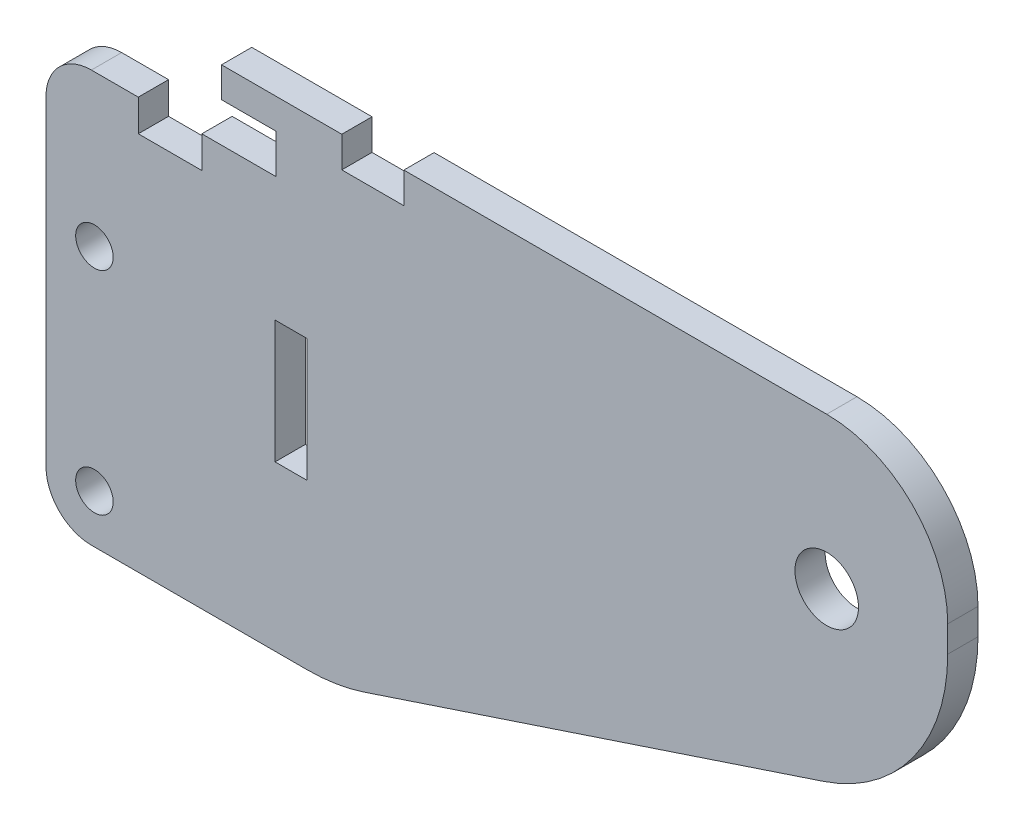
ISO-10303-21;
HEADER;
FILE_DESCRIPTION(('STEP AP214'),'2;1');
FILE_NAME('part.step','',(''),(''),'','','');
FILE_SCHEMA(('AUTOMOTIVE_DESIGN { 1 0 10303 214 1 1 1 1 }'));
ENDSEC;
DATA;
#1=APPLICATION_CONTEXT('core data for automotive mechanical design processes');
#2=APPLICATION_PROTOCOL_DEFINITION('international standard','automotive_design',2000,#1);
#3=PRODUCT_CONTEXT('',#1,'mechanical');
#4=PRODUCT('Part','Part','',(#3));
#5=PRODUCT_RELATED_PRODUCT_CATEGORY('part','',(#4));
#6=PRODUCT_DEFINITION_FORMATION('','',#4);
#7=PRODUCT_DEFINITION_CONTEXT('part definition',#1,'design');
#8=PRODUCT_DEFINITION('design','',#6,#7);
#9=PRODUCT_DEFINITION_SHAPE('','',#8);
#10=(LENGTH_UNIT() NAMED_UNIT(*) SI_UNIT(.MILLI.,.METRE.));
#11=(NAMED_UNIT(*) PLANE_ANGLE_UNIT() SI_UNIT($,.RADIAN.));
#12=(NAMED_UNIT(*) SI_UNIT($,.STERADIAN.) SOLID_ANGLE_UNIT());
#13=UNCERTAINTY_MEASURE_WITH_UNIT(LENGTH_MEASURE(1.E-05),#10,'distance_accuracy_value','');
#14=(GEOMETRIC_REPRESENTATION_CONTEXT(3) GLOBAL_UNCERTAINTY_ASSIGNED_CONTEXT((#13)) GLOBAL_UNIT_ASSIGNED_CONTEXT((#10,
#11,#12)) REPRESENTATION_CONTEXT('',''));
#15=CARTESIAN_POINT('',(0.,0.,0.));
#16=DIRECTION('',(0.,0.,1.));
#17=DIRECTION('',(1.,0.,0.));
#18=AXIS2_PLACEMENT_3D('',#15,#16,#17);
#19=CARTESIAN_POINT('',(0.,5.49999999999999,61.));
#20=DIRECTION('',(0.,1.,0.));
#21=DIRECTION('',(-1.,0.,0.));
#22=AXIS2_PLACEMENT_3D('',#19,#20,#21);
#23=PLANE('',#22);
#24=DIRECTION('',(0.,0.,1.));
#25=VECTOR('',#24,1.);
#26=CARTESIAN_POINT('',(21.125,5.49999999999999,0.));
#27=LINE('',#26,#25);
#28=CARTESIAN_POINT('',(21.125,5.49999999999999,56.));
#29=VERTEX_POINT('',#28);
#30=CARTESIAN_POINT('',(21.125,5.49999999999999,61.));
#31=VERTEX_POINT('',#30);
#32=EDGE_CURVE('E214',#29,#31,#27,.T.);
#33=ORIENTED_EDGE('',*,*,#32,.T.);
#34=DIRECTION('',(1.,0.,0.));
#35=VECTOR('',#34,1.);
#36=CARTESIAN_POINT('',(0.,5.49999999999999,61.));
#37=LINE('',#36,#35);
#38=CARTESIAN_POINT('',(91.,5.5,61.));
#39=VERTEX_POINT('',#38);
#40=EDGE_CURVE('E226',#31,#39,#37,.T.);
#41=ORIENTED_EDGE('',*,*,#40,.T.);
#42=DIRECTION('',(0.,0.,-1.));
#43=VECTOR('',#42,1.);
#44=CARTESIAN_POINT('',(91.,5.5,56.));
#45=LINE('',#44,#43);
#46=CARTESIAN_POINT('',(91.,5.5,56.));
#47=VERTEX_POINT('',#46);
#48=EDGE_CURVE('E307',#39,#47,#45,.T.);
#49=ORIENTED_EDGE('',*,*,#48,.T.);
#50=DIRECTION('',(1.,0.,0.));
#51=VECTOR('',#50,1.);
#52=CARTESIAN_POINT('',(0.,5.49999999999999,56.));
#53=LINE('',#52,#51);
#54=EDGE_CURVE('E228',#29,#47,#53,.T.);
#55=ORIENTED_EDGE('',*,*,#54,.F.);
#56=EDGE_LOOP('',(#33,#41,#49,#55));
#57=FACE_BOUND('',#56,.T.);
#58=ADVANCED_FACE('F38',(#57),#23,.T.);
#59=CARTESIAN_POINT('',(0.,-6.00000000000001,61.));
#60=DIRECTION('',(0.,-1.,0.));
#61=DIRECTION('',(1.,0.,0.));
#62=AXIS2_PLACEMENT_3D('',#59,#60,#61);
#63=PLANE('',#62);
#64=DIRECTION('',(-1.,0.,0.));
#65=VECTOR('',#64,1.);
#66=CARTESIAN_POINT('',(0.,-6.00000000000001,56.));
#67=LINE('',#66,#65);
#68=CARTESIAN_POINT('',(0.,-6.00000000000001,56.));
#69=VERTEX_POINT('',#68);
#70=CARTESIAN_POINT('',(-12.25,-6.00000000000001,56.));
#71=VERTEX_POINT('',#70);
#72=EDGE_CURVE('E288',#69,#71,#67,.T.);
#73=ORIENTED_EDGE('',*,*,#72,.T.);
#74=DIRECTION('',(0.,0.,1.));
#75=VECTOR('',#74,1.);
#76=CARTESIAN_POINT('',(-12.25,-6.00000000000001,61.));
#77=LINE('',#76,#75);
#78=CARTESIAN_POINT('',(-12.25,-6.00000000000001,61.));
#79=VERTEX_POINT('',#78);
#80=EDGE_CURVE('E268',#71,#79,#77,.T.);
#81=ORIENTED_EDGE('',*,*,#80,.T.);
#82=DIRECTION('',(-1.,0.,0.));
#83=VECTOR('',#82,1.);
#84=CARTESIAN_POINT('',(0.,-6.00000000000001,61.));
#85=LINE('',#84,#83);
#86=CARTESIAN_POINT('',(0.,-6.00000000000001,61.));
#87=VERTEX_POINT('',#86);
#88=EDGE_CURVE('E254',#87,#79,#85,.T.);
#89=ORIENTED_EDGE('',*,*,#88,.F.);
#90=DIRECTION('',(0.,0.,-1.));
#91=VECTOR('',#90,1.);
#92=CARTESIAN_POINT('',(0.,-6.00000000000001,61.));
#93=LINE('',#92,#91);
#94=EDGE_CURVE('E263',#87,#69,#93,.T.);
#95=ORIENTED_EDGE('',*,*,#94,.T.);
#96=EDGE_LOOP('',(#73,#81,#89,#95));
#97=FACE_BOUND('',#96,.T.);
#98=ADVANCED_FACE('F466',(#97),#63,.F.);
#99=CARTESIAN_POINT('',(23.1030402048882,-69.6539421102599,61.));
#100=DIRECTION('',(-0.314817785052065,0.94915212806742,0.));
#101=DIRECTION('',(-0.94915212806742,-0.314817785052065,0.));
#102=AXIS2_PLACEMENT_3D('',#99,#100,#101);
#103=PLANE('',#102);
#104=DIRECTION('',(0.94915212806742,0.314817785052065,0.));
#105=VECTOR('',#104,1.);
#106=CARTESIAN_POINT('',(23.1030402048882,-69.6539421102599,56.));
#107=LINE('',#106,#105);
#108=CARTESIAN_POINT('',(14.5990761777826,-72.4745638420226,56.));
#109=VERTEX_POINT('',#108);
#110=CARTESIAN_POINT('',(90.444533551562,-47.3179022378483,56.));
#111=VERTEX_POINT('',#110);
#112=EDGE_CURVE('E271',#109,#111,#107,.T.);
#113=ORIENTED_EDGE('',*,*,#112,.T.);
#114=DIRECTION('',(0.,0.,-1.));
#115=VECTOR('',#114,1.);
#116=CARTESIAN_POINT('',(90.444533551562,-47.3179022378483,61.));
#117=LINE('',#116,#115);
#118=CARTESIAN_POINT('',(90.444533551562,-47.3179022378483,61.));
#119=VERTEX_POINT('',#118);
#120=EDGE_CURVE('E337',#111,#119,#117,.F.);
#121=ORIENTED_EDGE('',*,*,#120,.T.);
#122=DIRECTION('',(0.94915212806742,0.314817785052065,0.));
#123=VECTOR('',#122,1.);
#124=CARTESIAN_POINT('',(23.1030402048882,-69.6539421102599,61.));
#125=LINE('',#124,#123);
#126=CARTESIAN_POINT('',(14.5990761777826,-72.4745638420226,61.));
#127=VERTEX_POINT('',#126);
#128=EDGE_CURVE('E243',#127,#119,#125,.T.);
#129=ORIENTED_EDGE('',*,*,#128,.F.);
#130=DIRECTION('',(0.,0.,-1.));
#131=VECTOR('',#130,1.);
#132=CARTESIAN_POINT('',(14.5990761777826,-72.4745638420226,61.));
#133=LINE('',#132,#131);
#134=EDGE_CURVE('E334',#127,#109,#133,.T.);
#135=ORIENTED_EDGE('',*,*,#134,.T.);
#136=EDGE_LOOP('',(#113,#121,#129,#135));
#137=FACE_BOUND('',#136,.T.);
#138=ADVANCED_FACE('F472',(#137),#103,.F.);
#139=CARTESIAN_POINT('',(111.,0.,61.));
#140=DIRECTION('',(-1.,0.,0.));
#141=DIRECTION('',(0.,-1.,0.));
#142=AXIS2_PLACEMENT_3D('',#139,#140,#141);
#143=PLANE('',#142);
#144=DIRECTION('',(0.,1.,0.));
#145=VECTOR('',#144,1.);
#146=CARTESIAN_POINT('',(111.,0.,56.));
#147=LINE('',#146,#145);
#148=CARTESIAN_POINT('',(111.,-18.8433383958257,56.));
#149=VERTEX_POINT('',#148);
#150=CARTESIAN_POINT('',(111.,-14.5,56.));
#151=VERTEX_POINT('',#150);
#152=EDGE_CURVE('E274',#149,#151,#147,.T.);
#153=ORIENTED_EDGE('',*,*,#152,.T.);
#154=DIRECTION('',(0.,0.,-1.));
#155=VECTOR('',#154,1.);
#156=CARTESIAN_POINT('',(111.,-14.5,61.));
#157=LINE('',#156,#155);
#158=CARTESIAN_POINT('',(111.,-14.5,61.));
#159=VERTEX_POINT('',#158);
#160=EDGE_CURVE('E323',#151,#159,#157,.F.);
#161=ORIENTED_EDGE('',*,*,#160,.T.);
#162=DIRECTION('',(0.,1.,0.));
#163=VECTOR('',#162,1.);
#164=CARTESIAN_POINT('',(111.,0.,61.));
#165=LINE('',#164,#163);
#166=CARTESIAN_POINT('',(111.,-18.8433383958257,61.));
#167=VERTEX_POINT('',#166);
#168=EDGE_CURVE('E239',#167,#159,#165,.T.);
#169=ORIENTED_EDGE('',*,*,#168,.F.);
#170=DIRECTION('',(0.,0.,-1.));
#171=VECTOR('',#170,1.);
#172=CARTESIAN_POINT('',(111.,-18.8433383958257,61.));
#173=LINE('',#172,#171);
#174=EDGE_CURVE('E320',#167,#149,#173,.T.);
#175=ORIENTED_EDGE('',*,*,#174,.T.);
#176=EDGE_LOOP('',(#153,#161,#169,#175));
#177=FACE_BOUND('',#176,.T.);
#178=ADVANCED_FACE('F448',(#177),#143,.F.);
#179=DIRECTION('',(0.,0.,1.));
#180=VECTOR('',#179,1.);
#181=CARTESIAN_POINT('',(10.875,5.5,0.));
#182=LINE('',#181,#180);
#183=CARTESIAN_POINT('',(10.875,5.5,56.));
#184=VERTEX_POINT('',#183);
#185=CARTESIAN_POINT('',(10.875,5.5,61.));
#186=VERTEX_POINT('',#185);
#187=EDGE_CURVE('E229',#184,#186,#182,.T.);
#188=ORIENTED_EDGE('',*,*,#187,.F.);
#189=CARTESIAN_POINT('',(-9.,5.49999999999999,56.));
#190=VERTEX_POINT('',#189);
#191=EDGE_CURVE('E277',#190,#184,#53,.T.);
#192=ORIENTED_EDGE('',*,*,#191,.F.);
#193=DIRECTION('',(0.,0.,-1.));
#194=VECTOR('',#193,1.);
#195=CARTESIAN_POINT('',(-9.,5.49999999999999,61.));
#196=LINE('',#195,#194);
#197=CARTESIAN_POINT('',(-9.,5.49999999999999,61.));
#198=VERTEX_POINT('',#197);
#199=EDGE_CURVE('E305',#198,#190,#196,.T.);
#200=ORIENTED_EDGE('',*,*,#199,.F.);
#201=EDGE_CURVE('E238',#198,#186,#37,.T.);
#202=ORIENTED_EDGE('',*,*,#201,.T.);
#203=EDGE_LOOP('',(#188,#192,#200,#202));
#204=FACE_BOUND('',#203,.T.);
#205=ADVANCED_FACE('F468',(#204),#23,.T.);
#206=CARTESIAN_POINT('',(-9.,0.,61.));
#207=DIRECTION('',(-1.,0.,0.));
#208=DIRECTION('',(0.,0.,1.));
#209=AXIS2_PLACEMENT_3D('',#206,#207,#208);
#210=PLANE('',#209);
#211=DIRECTION('',(0.,1.,0.));
#212=VECTOR('',#211,1.);
#213=CARTESIAN_POINT('',(-9.,0.,56.));
#214=LINE('',#213,#212);
#215=CARTESIAN_POINT('',(-9.,0.49999999999999,56.));
#216=VERTEX_POINT('',#215);
#217=EDGE_CURVE('E280',#216,#190,#214,.T.);
#218=ORIENTED_EDGE('',*,*,#217,.F.);
#219=DIRECTION('',(0.,0.,-1.));
#220=VECTOR('',#219,1.);
#221=CARTESIAN_POINT('',(-9.,0.49999999999999,61.));
#222=LINE('',#221,#220);
#223=CARTESIAN_POINT('',(-9.,0.49999999999999,61.));
#224=VERTEX_POINT('',#223);
#225=EDGE_CURVE('E303',#224,#216,#222,.T.);
#226=ORIENTED_EDGE('',*,*,#225,.F.);
#227=DIRECTION('',(0.,1.,0.));
#228=VECTOR('',#227,1.);
#229=CARTESIAN_POINT('',(-9.,0.,61.));
#230=LINE('',#229,#228);
#231=EDGE_CURVE('E242',#224,#198,#230,.T.);
#232=ORIENTED_EDGE('',*,*,#231,.T.);
#233=ORIENTED_EDGE('',*,*,#199,.T.);
#234=EDGE_LOOP('',(#218,#226,#232,#233));
#235=FACE_BOUND('',#234,.T.);
#236=ADVANCED_FACE('F479',(#235),#210,.T.);
#237=CARTESIAN_POINT('',(0.,0.49999999999999,61.));
#238=DIRECTION('',(0.,1.,0.));
#239=DIRECTION('',(0.,0.,1.));
#240=AXIS2_PLACEMENT_3D('',#237,#238,#239);
#241=PLANE('',#240);
#242=DIRECTION('',(1.,0.,0.));
#243=VECTOR('',#242,1.);
#244=CARTESIAN_POINT('',(0.,0.49999999999999,56.));
#245=LINE('',#244,#243);
#246=CARTESIAN_POINT('',(0.,0.49999999999999,56.));
#247=VERTEX_POINT('',#246);
#248=EDGE_CURVE('E283',#216,#247,#245,.T.);
#249=ORIENTED_EDGE('',*,*,#248,.T.);
#250=DIRECTION('',(0.,0.,-1.));
#251=VECTOR('',#250,1.);
#252=CARTESIAN_POINT('',(0.,0.49999999999999,61.));
#253=LINE('',#252,#251);
#254=CARTESIAN_POINT('',(0.,0.49999999999999,61.));
#255=VERTEX_POINT('',#254);
#256=EDGE_CURVE('E300',#255,#247,#253,.T.);
#257=ORIENTED_EDGE('',*,*,#256,.F.);
#258=DIRECTION('',(1.,0.,0.));
#259=VECTOR('',#258,1.);
#260=CARTESIAN_POINT('',(0.,0.49999999999999,61.));
#261=LINE('',#260,#259);
#262=EDGE_CURVE('E249',#224,#255,#261,.T.);
#263=ORIENTED_EDGE('',*,*,#262,.F.);
#264=ORIENTED_EDGE('',*,*,#225,.T.);
#265=EDGE_LOOP('',(#249,#257,#263,#264));
#266=FACE_BOUND('',#265,.T.);
#267=ADVANCED_FACE('F485',(#266),#241,.F.);
#268=CARTESIAN_POINT('',(0.,0.,61.));
#269=DIRECTION('',(1.,0.,0.));
#270=DIRECTION('',(0.,1.,0.));
#271=AXIS2_PLACEMENT_3D('',#268,#269,#270);
#272=PLANE('',#271);
#273=DIRECTION('',(0.,-1.,0.));
#274=VECTOR('',#273,1.);
#275=CARTESIAN_POINT('',(0.,0.,56.));
#276=LINE('',#275,#274);
#277=EDGE_CURVE('E285',#247,#69,#276,.T.);
#278=ORIENTED_EDGE('',*,*,#277,.T.);
#279=ORIENTED_EDGE('',*,*,#94,.F.);
#280=DIRECTION('',(0.,-1.,0.));
#281=VECTOR('',#280,1.);
#282=CARTESIAN_POINT('',(0.,0.,61.));
#283=LINE('',#282,#281);
#284=EDGE_CURVE('E251',#255,#87,#283,.T.);
#285=ORIENTED_EDGE('',*,*,#284,.F.);
#286=ORIENTED_EDGE('',*,*,#256,.T.);
#287=EDGE_LOOP('',(#278,#279,#285,#286));
#288=FACE_BOUND('',#287,.T.);
#289=ADVANCED_FACE('F550',(#288),#272,.F.);
#290=CARTESIAN_POINT('',(-22.75,-6.00000000000002,61.));
#291=VERTEX_POINT('',#290);
#292=CARTESIAN_POINT('',(-30.5,-6.00000000000001,61.));
#293=VERTEX_POINT('',#292);
#294=EDGE_CURVE('E253',#291,#293,#85,.T.);
#295=ORIENTED_EDGE('',*,*,#294,.F.);
#296=DIRECTION('',(0.,0.,-1.));
#297=VECTOR('',#296,1.);
#298=CARTESIAN_POINT('',(-22.75,-6.00000000000002,61.));
#299=LINE('',#298,#297);
#300=CARTESIAN_POINT('',(-22.75,-6.00000000000002,56.));
#301=VERTEX_POINT('',#300);
#302=EDGE_CURVE('E416',#291,#301,#299,.T.);
#303=ORIENTED_EDGE('',*,*,#302,.T.);
#304=CARTESIAN_POINT('',(-30.5,-6.00000000000001,56.));
#305=VERTEX_POINT('',#304);
#306=EDGE_CURVE('E287',#301,#305,#67,.T.);
#307=ORIENTED_EDGE('',*,*,#306,.T.);
#308=DIRECTION('',(0.,0.,-1.));
#309=VECTOR('',#308,1.);
#310=CARTESIAN_POINT('',(-30.5,-6.00000000000001,61.));
#311=LINE('',#310,#309);
#312=EDGE_CURVE('E349',#305,#293,#311,.F.);
#313=ORIENTED_EDGE('',*,*,#312,.T.);
#314=EDGE_LOOP('',(#295,#303,#307,#313));
#315=FACE_BOUND('',#314,.T.);
#316=ADVANCED_FACE('F475',(#315),#63,.F.);
#317=CARTESIAN_POINT('',(-38.,0.,61.));
#318=DIRECTION('',(1.,0.,0.));
#319=DIRECTION('',(0.,1.,0.));
#320=AXIS2_PLACEMENT_3D('',#317,#318,#319);
#321=PLANE('',#320);
#322=DIRECTION('',(0.,-1.,0.));
#323=VECTOR('',#322,1.);
#324=CARTESIAN_POINT('',(-38.,0.,61.));
#325=LINE('',#324,#323);
#326=CARTESIAN_POINT('',(-38.,-13.5,61.));
#327=VERTEX_POINT('',#326);
#328=CARTESIAN_POINT('',(-38.,-66.5,61.));
#329=VERTEX_POINT('',#328);
#330=EDGE_CURVE('E257',#327,#329,#325,.T.);
#331=ORIENTED_EDGE('',*,*,#330,.F.);
#332=DIRECTION('',(0.,0.,-1.));
#333=VECTOR('',#332,1.);
#334=CARTESIAN_POINT('',(-38.,-13.5,61.));
#335=LINE('',#334,#333);
#336=CARTESIAN_POINT('',(-38.,-13.5,56.));
#337=VERTEX_POINT('',#336);
#338=EDGE_CURVE('E346',#327,#337,#335,.T.);
#339=ORIENTED_EDGE('',*,*,#338,.T.);
#340=DIRECTION('',(0.,-1.,0.));
#341=VECTOR('',#340,1.);
#342=CARTESIAN_POINT('',(-38.,0.,56.));
#343=LINE('',#342,#341);
#344=CARTESIAN_POINT('',(-38.,-66.5,56.));
#345=VERTEX_POINT('',#344);
#346=EDGE_CURVE('E291',#337,#345,#343,.T.);
#347=ORIENTED_EDGE('',*,*,#346,.T.);
#348=DIRECTION('',(0.,0.,-1.));
#349=VECTOR('',#348,1.);
#350=CARTESIAN_POINT('',(-38.,-66.5,61.));
#351=LINE('',#350,#349);
#352=EDGE_CURVE('E344',#345,#329,#351,.F.);
#353=ORIENTED_EDGE('',*,*,#352,.T.);
#354=EDGE_LOOP('',(#331,#339,#347,#353));
#355=FACE_BOUND('',#354,.T.);
#356=ADVANCED_FACE('F544',(#355),#321,.F.);
#357=CARTESIAN_POINT('',(-30.,-31.,61.));
#358=DIRECTION('',(0.,0.,-1.));
#359=DIRECTION('',(-1.,0.,0.));
#360=AXIS2_PLACEMENT_3D('',#357,#358,#359);
#361=CYLINDRICAL_SURFACE('',#360,3.1);
#362=CARTESIAN_POINT('',(-30.,-31.,61.));
#363=DIRECTION('',(0.,0.,1.));
#364=DIRECTION('',(1.,0.,0.));
#365=AXIS2_PLACEMENT_3D('',#362,#363,#364);
#366=CIRCLE('',#365,3.1);
#367=CARTESIAN_POINT('',(-26.9,-31.,61.));
#368=VERTEX_POINT('',#367);
#369=EDGE_CURVE('E433',#368,#368,#366,.T.);
#370=ORIENTED_EDGE('',*,*,#369,.T.);
#371=EDGE_LOOP('',(#370));
#372=FACE_BOUND('',#371,.T.);
#373=CARTESIAN_POINT('',(-30.,-31.,56.));
#374=DIRECTION('',(0.,0.,1.));
#375=DIRECTION('',(1.,0.,0.));
#376=AXIS2_PLACEMENT_3D('',#373,#374,#375);
#377=CIRCLE('',#376,3.1);
#378=CARTESIAN_POINT('',(-26.9,-31.,56.));
#379=VERTEX_POINT('',#378);
#380=EDGE_CURVE('E267',#379,#379,#377,.T.);
#381=ORIENTED_EDGE('',*,*,#380,.F.);
#382=EDGE_LOOP('',(#381));
#383=FACE_BOUND('',#382,.T.);
#384=ADVANCED_FACE('F546',(#372,#383),#361,.F.);
#385=CARTESIAN_POINT('',(-30.,-66.,61.));
#386=DIRECTION('',(0.,0.,-1.));
#387=DIRECTION('',(-1.,0.,0.));
#388=AXIS2_PLACEMENT_3D('',#385,#386,#387);
#389=CYLINDRICAL_SURFACE('',#388,3.1);
#390=CARTESIAN_POINT('',(-30.,-66.,61.));
#391=DIRECTION('',(0.,0.,1.));
#392=DIRECTION('',(1.,0.,0.));
#393=AXIS2_PLACEMENT_3D('',#390,#391,#392);
#394=CIRCLE('',#393,3.1);
#395=CARTESIAN_POINT('',(-26.9,-66.,61.));
#396=VERTEX_POINT('',#395);
#397=EDGE_CURVE('E297',#396,#396,#394,.T.);
#398=ORIENTED_EDGE('',*,*,#397,.T.);
#399=EDGE_LOOP('',(#398));
#400=FACE_BOUND('',#399,.T.);
#401=CARTESIAN_POINT('',(-30.,-66.,56.));
#402=DIRECTION('',(0.,0.,1.));
#403=DIRECTION('',(1.,0.,0.));
#404=AXIS2_PLACEMENT_3D('',#401,#402,#403);
#405=CIRCLE('',#404,3.1);
#406=CARTESIAN_POINT('',(-26.9,-66.,56.));
#407=VERTEX_POINT('',#406);
#408=EDGE_CURVE('E264',#407,#407,#405,.T.);
#409=ORIENTED_EDGE('',*,*,#408,.F.);
#410=EDGE_LOOP('',(#409));
#411=FACE_BOUND('',#410,.T.);
#412=ADVANCED_FACE('F542',(#400,#411),#389,.F.);
#413=CARTESIAN_POINT('',(0.,-74.,61.));
#414=DIRECTION('',(0.,1.,0.));
#415=DIRECTION('',(0.,0.,1.));
#416=AXIS2_PLACEMENT_3D('',#413,#414,#415);
#417=PLANE('',#416);
#418=DIRECTION('',(1.,0.,0.));
#419=VECTOR('',#418,1.);
#420=CARTESIAN_POINT('',(0.,-74.,56.));
#421=LINE('',#420,#419);
#422=CARTESIAN_POINT('',(-30.5,-74.,56.));
#423=VERTEX_POINT('',#422);
#424=CARTESIAN_POINT('',(5.15454262622068,-74.,56.));
#425=VERTEX_POINT('',#424);
#426=EDGE_CURVE('E294',#423,#425,#421,.T.);
#427=ORIENTED_EDGE('',*,*,#426,.T.);
#428=DIRECTION('',(0.,0.,-1.));
#429=VECTOR('',#428,1.);
#430=CARTESIAN_POINT('',(5.15454262622068,-74.,61.));
#431=LINE('',#430,#429);
#432=CARTESIAN_POINT('',(5.15454262622068,-74.,61.));
#433=VERTEX_POINT('',#432);
#434=EDGE_CURVE('E342',#425,#433,#431,.F.);
#435=ORIENTED_EDGE('',*,*,#434,.T.);
#436=DIRECTION('',(1.,0.,0.));
#437=VECTOR('',#436,1.);
#438=CARTESIAN_POINT('',(0.,-74.,61.));
#439=LINE('',#438,#437);
#440=CARTESIAN_POINT('',(-30.5,-74.,61.));
#441=VERTEX_POINT('',#440);
#442=EDGE_CURVE('E260',#441,#433,#439,.T.);
#443=ORIENTED_EDGE('',*,*,#442,.F.);
#444=DIRECTION('',(0.,0.,-1.));
#445=VECTOR('',#444,1.);
#446=CARTESIAN_POINT('',(-30.5,-74.,61.));
#447=LINE('',#446,#445);
#448=EDGE_CURVE('E339',#441,#423,#447,.T.);
#449=ORIENTED_EDGE('',*,*,#448,.T.);
#450=EDGE_LOOP('',(#427,#435,#443,#449));
#451=FACE_BOUND('',#450,.T.);
#452=ADVANCED_FACE('F538',(#451),#417,.F.);
#453=CARTESIAN_POINT('',(0.,0.,61.));
#454=DIRECTION('',(0.,0.,1.));
#455=DIRECTION('',(1.,0.,0.));
#456=AXIS2_PLACEMENT_3D('',#453,#454,#455);
#457=PLANE('',#456);
#458=DIRECTION('',(0.,1.,0.));
#459=VECTOR('',#458,1.);
#460=CARTESIAN_POINT('',(21.125,5.49999999999999,61.));
#461=LINE('',#460,#459);
#462=CARTESIAN_POINT('',(21.125,0.400000000000001,61.));
#463=VERTEX_POINT('',#462);
#464=EDGE_CURVE('E211',#463,#31,#461,.T.);
#465=ORIENTED_EDGE('',*,*,#464,.F.);
#466=DIRECTION('',(1.,0.,0.));
#467=VECTOR('',#466,1.);
#468=CARTESIAN_POINT('',(21.125,0.400000000000001,61.));
#469=LINE('',#468,#467);
#470=CARTESIAN_POINT('',(10.875,0.399999999999994,61.));
#471=VERTEX_POINT('',#470);
#472=EDGE_CURVE('E230',#471,#463,#469,.T.);
#473=ORIENTED_EDGE('',*,*,#472,.F.);
#474=DIRECTION('',(0.,-1.,0.));
#475=VECTOR('',#474,1.);
#476=CARTESIAN_POINT('',(10.875,5.5,61.));
#477=LINE('',#476,#475);
#478=EDGE_CURVE('E221',#186,#471,#477,.T.);
#479=ORIENTED_EDGE('',*,*,#478,.F.);
#480=ORIENTED_EDGE('',*,*,#201,.F.);
#481=ORIENTED_EDGE('',*,*,#231,.F.);
#482=ORIENTED_EDGE('',*,*,#262,.T.);
#483=ORIENTED_EDGE('',*,*,#284,.T.);
#484=ORIENTED_EDGE('',*,*,#88,.T.);
#485=DIRECTION('',(0.,-1.,0.));
#486=VECTOR('',#485,1.);
#487=CARTESIAN_POINT('',(-12.25,-11.25,61.));
#488=LINE('',#487,#486);
#489=CARTESIAN_POINT('',(-12.25,-11.25,61.));
#490=VERTEX_POINT('',#489);
#491=EDGE_CURVE('E406',#79,#490,#488,.T.);
#492=ORIENTED_EDGE('',*,*,#491,.T.);
#493=DIRECTION('',(-1.,0.,0.));
#494=VECTOR('',#493,1.);
#495=CARTESIAN_POINT('',(-12.25,-11.25,61.));
#496=LINE('',#495,#494);
#497=CARTESIAN_POINT('',(-22.75,-11.25,61.));
#498=VERTEX_POINT('',#497);
#499=EDGE_CURVE('E418',#490,#498,#496,.T.);
#500=ORIENTED_EDGE('',*,*,#499,.T.);
#501=DIRECTION('',(0.,1.,0.));
#502=VECTOR('',#501,1.);
#503=CARTESIAN_POINT('',(-22.75,-11.25,61.));
#504=LINE('',#503,#502);
#505=EDGE_CURVE('E413',#498,#291,#504,.T.);
#506=ORIENTED_EDGE('',*,*,#505,.T.);
#507=ORIENTED_EDGE('',*,*,#294,.T.);
#508=CARTESIAN_POINT('',(-30.5,-13.5,61.));
#509=DIRECTION('',(0.,0.,1.));
#510=DIRECTION('',(1.,0.,0.));
#511=AXIS2_PLACEMENT_3D('',#508,#509,#510);
#512=CIRCLE('',#511,7.5);
#513=EDGE_CURVE('E327',#293,#327,#512,.T.);
#514=ORIENTED_EDGE('',*,*,#513,.T.);
#515=ORIENTED_EDGE('',*,*,#330,.T.);
#516=CARTESIAN_POINT('',(-30.5,-66.5,61.));
#517=DIRECTION('',(0.,0.,1.));
#518=DIRECTION('',(1.,0.,0.));
#519=AXIS2_PLACEMENT_3D('',#516,#517,#518);
#520=CIRCLE('',#519,7.5);
#521=EDGE_CURVE('E325',#329,#441,#520,.T.);
#522=ORIENTED_EDGE('',*,*,#521,.T.);
#523=ORIENTED_EDGE('',*,*,#442,.T.);
#524=CARTESIAN_POINT('',(5.15454262622068,-44.,61.));
#525=DIRECTION('',(0.,0.,1.));
#526=DIRECTION('',(1.,0.,0.));
#527=AXIS2_PLACEMENT_3D('',#524,#525,#526);
#528=CIRCLE('',#527,30.);
#529=EDGE_CURVE('E329',#433,#127,#528,.T.);
#530=ORIENTED_EDGE('',*,*,#529,.T.);
#531=ORIENTED_EDGE('',*,*,#128,.T.);
#532=CARTESIAN_POINT('',(81.,-18.8433383958257,61.));
#533=DIRECTION('',(0.,0.,1.));
#534=DIRECTION('',(1.,0.,0.));
#535=AXIS2_PLACEMENT_3D('',#532,#533,#534);
#536=CIRCLE('',#535,30.);
#537=EDGE_CURVE('E331',#119,#167,#536,.T.);
#538=ORIENTED_EDGE('',*,*,#537,.T.);
#539=ORIENTED_EDGE('',*,*,#168,.T.);
#540=CARTESIAN_POINT('',(91.,-14.5,61.));
#541=DIRECTION('',(0.,0.,1.));
#542=DIRECTION('',(1.,0.,0.));
#543=AXIS2_PLACEMENT_3D('',#540,#541,#542);
#544=CIRCLE('',#543,20.);
#545=EDGE_CURVE('E236',#159,#39,#544,.T.);
#546=ORIENTED_EDGE('',*,*,#545,.T.);
#547=ORIENTED_EDGE('',*,*,#40,.F.);
#548=EDGE_LOOP('',(#465,#473,#479,#480,#481,#482,#483,#484,#492,#500,#506,#507,#514,#515,#522,
#523,#530,#531,#538,#539,#546,#547));
#549=FACE_BOUND('',#548,.T.);
#550=CARTESIAN_POINT('',(91.,-19.5,61.));
#551=DIRECTION('',(0.,0.,1.));
#552=DIRECTION('',(1.,0.,0.));
#553=AXIS2_PLACEMENT_3D('',#550,#551,#552);
#554=CIRCLE('',#553,5.25);
#555=CARTESIAN_POINT('',(96.25,-19.5,61.));
#556=VERTEX_POINT('',#555);
#557=EDGE_CURVE('E378',#556,#556,#554,.T.);
#558=ORIENTED_EDGE('',*,*,#557,.F.);
#559=EDGE_LOOP('',(#558));
#560=FACE_BOUND('',#559,.T.);
#561=DIRECTION('',(0.,-1.,0.));
#562=VECTOR('',#561,1.);
#563=CARTESIAN_POINT('',(5.15,-26.5998009701519,61.));
#564=LINE('',#563,#562);
#565=CARTESIAN_POINT('',(5.15,-26.5998009701519,61.));
#566=VERTEX_POINT('',#565);
#567=CARTESIAN_POINT('',(5.15,-46.8998009701519,61.));
#568=VERTEX_POINT('',#567);
#569=EDGE_CURVE('E377',#566,#568,#564,.T.);
#570=ORIENTED_EDGE('',*,*,#569,.T.);
#571=DIRECTION('',(-1.,0.,0.));
#572=VECTOR('',#571,1.);
#573=CARTESIAN_POINT('',(5.15,-46.8998009701519,61.));
#574=LINE('',#573,#572);
#575=CARTESIAN_POINT('',(-0.150000000000004,-46.8998009701519,61.));
#576=VERTEX_POINT('',#575);
#577=EDGE_CURVE('E395',#568,#576,#574,.T.);
#578=ORIENTED_EDGE('',*,*,#577,.T.);
#579=DIRECTION('',(0.,1.,0.));
#580=VECTOR('',#579,1.);
#581=CARTESIAN_POINT('',(-0.149999999999994,-26.5998009701519,61.));
#582=LINE('',#581,#580);
#583=CARTESIAN_POINT('',(-0.149999999999994,-26.5998009701519,61.));
#584=VERTEX_POINT('',#583);
#585=EDGE_CURVE('E61',#576,#584,#582,.T.);
#586=ORIENTED_EDGE('',*,*,#585,.T.);
#587=DIRECTION('',(1.,0.,0.));
#588=VECTOR('',#587,1.);
#589=CARTESIAN_POINT('',(5.15,-26.5998009701519,61.));
#590=LINE('',#589,#588);
#591=EDGE_CURVE('E399',#584,#566,#590,.T.);
#592=ORIENTED_EDGE('',*,*,#591,.T.);
#593=EDGE_LOOP('',(#570,#578,#586,#592));
#594=FACE_BOUND('',#593,.T.);
#595=ORIENTED_EDGE('',*,*,#397,.F.);
#596=EDGE_LOOP('',(#595));
#597=FACE_BOUND('',#596,.T.);
#598=ORIENTED_EDGE('',*,*,#369,.F.);
#599=EDGE_LOOP('',(#598));
#600=FACE_BOUND('',#599,.T.);
#601=ADVANCED_FACE('F232',(#549,#560,#594,#597,#600),#457,.T.);
#602=CARTESIAN_POINT('',(0.,0.,56.));
#603=DIRECTION('',(0.,0.,1.));
#604=DIRECTION('',(1.,0.,0.));
#605=AXIS2_PLACEMENT_3D('',#602,#603,#604);
#606=PLANE('',#605);
#607=CARTESIAN_POINT('',(91.,-19.5,56.));
#608=DIRECTION('',(0.,0.,1.));
#609=DIRECTION('',(1.,0.,0.));
#610=AXIS2_PLACEMENT_3D('',#607,#608,#609);
#611=CIRCLE('',#610,5.25);
#612=CARTESIAN_POINT('',(96.25,-19.5,56.));
#613=VERTEX_POINT('',#612);
#614=EDGE_CURVE('E374',#613,#613,#611,.T.);
#615=ORIENTED_EDGE('',*,*,#614,.T.);
#616=EDGE_LOOP('',(#615));
#617=FACE_BOUND('',#616,.T.);
#618=DIRECTION('',(1.,0.,0.));
#619=VECTOR('',#618,1.);
#620=CARTESIAN_POINT('',(0.,-46.8998009701519,56.));
#621=LINE('',#620,#619);
#622=CARTESIAN_POINT('',(-0.150000000000004,-46.8998009701519,56.));
#623=VERTEX_POINT('',#622);
#624=CARTESIAN_POINT('',(5.15,-46.8998009701519,56.));
#625=VERTEX_POINT('',#624);
#626=EDGE_CURVE('E361',#623,#625,#621,.T.);
#627=ORIENTED_EDGE('',*,*,#626,.T.);
#628=DIRECTION('',(0.,1.,0.));
#629=VECTOR('',#628,1.);
#630=CARTESIAN_POINT('',(5.15,0.,56.));
#631=LINE('',#630,#629);
#632=CARTESIAN_POINT('',(5.15,-26.5998009701519,56.));
#633=VERTEX_POINT('',#632);
#634=EDGE_CURVE('E370',#625,#633,#631,.T.);
#635=ORIENTED_EDGE('',*,*,#634,.T.);
#636=DIRECTION('',(-1.,0.,0.));
#637=VECTOR('',#636,1.);
#638=CARTESIAN_POINT('',(0.,-26.5998009701519,56.));
#639=LINE('',#638,#637);
#640=CARTESIAN_POINT('',(-0.149999999999994,-26.5998009701519,56.));
#641=VERTEX_POINT('',#640);
#642=EDGE_CURVE('E367',#633,#641,#639,.T.);
#643=ORIENTED_EDGE('',*,*,#642,.T.);
#644=DIRECTION('',(0.,-1.,0.));
#645=VECTOR('',#644,1.);
#646=CARTESIAN_POINT('',(-0.149999999999997,0.,56.));
#647=LINE('',#646,#645);
#648=EDGE_CURVE('E364',#641,#623,#647,.T.);
#649=ORIENTED_EDGE('',*,*,#648,.T.);
#650=EDGE_LOOP('',(#627,#635,#643,#649));
#651=FACE_BOUND('',#650,.T.);
#652=ORIENTED_EDGE('',*,*,#408,.T.);
#653=EDGE_LOOP('',(#652));
#654=FACE_BOUND('',#653,.T.);
#655=ORIENTED_EDGE('',*,*,#380,.T.);
#656=EDGE_LOOP('',(#655));
#657=FACE_BOUND('',#656,.T.);
#658=DIRECTION('',(1.,0.,0.));
#659=VECTOR('',#658,1.);
#660=CARTESIAN_POINT('',(0.,0.399999999999994,56.));
#661=LINE('',#660,#659);
#662=CARTESIAN_POINT('',(10.875,0.399999999999994,56.));
#663=VERTEX_POINT('',#662);
#664=CARTESIAN_POINT('',(21.125,0.400000000000001,56.));
#665=VERTEX_POINT('',#664);
#666=EDGE_CURVE('E46',#663,#665,#661,.T.);
#667=ORIENTED_EDGE('',*,*,#666,.T.);
#668=DIRECTION('',(0.,1.,0.));
#669=VECTOR('',#668,1.);
#670=CARTESIAN_POINT('',(21.125,0.,56.));
#671=LINE('',#670,#669);
#672=EDGE_CURVE('E12',#665,#29,#671,.T.);
#673=ORIENTED_EDGE('',*,*,#672,.T.);
#674=ORIENTED_EDGE('',*,*,#54,.T.);
#675=CARTESIAN_POINT('',(91.,-14.5,56.));
#676=DIRECTION('',(0.,0.,1.));
#677=DIRECTION('',(1.,0.,0.));
#678=AXIS2_PLACEMENT_3D('',#675,#676,#677);
#679=CIRCLE('',#678,20.);
#680=EDGE_CURVE('E318',#47,#151,#679,.F.);
#681=ORIENTED_EDGE('',*,*,#680,.T.);
#682=ORIENTED_EDGE('',*,*,#152,.F.);
#683=CARTESIAN_POINT('',(81.,-18.8433383958257,56.));
#684=DIRECTION('',(0.,0.,1.));
#685=DIRECTION('',(1.,0.,0.));
#686=AXIS2_PLACEMENT_3D('',#683,#684,#685);
#687=CIRCLE('',#686,30.);
#688=EDGE_CURVE('E316',#149,#111,#687,.F.);
#689=ORIENTED_EDGE('',*,*,#688,.T.);
#690=ORIENTED_EDGE('',*,*,#112,.F.);
#691=CARTESIAN_POINT('',(5.15454262622068,-44.,56.));
#692=DIRECTION('',(0.,0.,1.));
#693=DIRECTION('',(1.,0.,0.));
#694=AXIS2_PLACEMENT_3D('',#691,#692,#693);
#695=CIRCLE('',#694,30.);
#696=EDGE_CURVE('E314',#109,#425,#695,.F.);
#697=ORIENTED_EDGE('',*,*,#696,.T.);
#698=ORIENTED_EDGE('',*,*,#426,.F.);
#699=CARTESIAN_POINT('',(-30.5,-66.5,56.));
#700=DIRECTION('',(0.,0.,1.));
#701=DIRECTION('',(1.,0.,0.));
#702=AXIS2_PLACEMENT_3D('',#699,#700,#701);
#703=CIRCLE('',#702,7.5);
#704=EDGE_CURVE('E309',#423,#345,#703,.F.);
#705=ORIENTED_EDGE('',*,*,#704,.T.);
#706=ORIENTED_EDGE('',*,*,#346,.F.);
#707=CARTESIAN_POINT('',(-30.5,-13.5,56.));
#708=DIRECTION('',(0.,0.,1.));
#709=DIRECTION('',(1.,0.,0.));
#710=AXIS2_PLACEMENT_3D('',#707,#708,#709);
#711=CIRCLE('',#710,7.5);
#712=EDGE_CURVE('E311',#337,#305,#711,.F.);
#713=ORIENTED_EDGE('',*,*,#712,.T.);
#714=ORIENTED_EDGE('',*,*,#306,.F.);
#715=DIRECTION('',(0.,-1.,0.));
#716=VECTOR('',#715,1.);
#717=CARTESIAN_POINT('',(-22.75,0.,56.));
#718=LINE('',#717,#716);
#719=CARTESIAN_POINT('',(-22.75,-11.25,56.));
#720=VERTEX_POINT('',#719);
#721=EDGE_CURVE('E352',#301,#720,#718,.T.);
#722=ORIENTED_EDGE('',*,*,#721,.T.);
#723=DIRECTION('',(1.,0.,0.));
#724=VECTOR('',#723,1.);
#725=CARTESIAN_POINT('',(0.,-11.25,56.));
#726=LINE('',#725,#724);
#727=CARTESIAN_POINT('',(-12.25,-11.25,56.));
#728=VERTEX_POINT('',#727);
#729=EDGE_CURVE('E355',#720,#728,#726,.T.);
#730=ORIENTED_EDGE('',*,*,#729,.T.);
#731=DIRECTION('',(0.,1.,0.));
#732=VECTOR('',#731,1.);
#733=CARTESIAN_POINT('',(-12.25,0.,56.));
#734=LINE('',#733,#732);
#735=EDGE_CURVE('E358',#728,#71,#734,.T.);
#736=ORIENTED_EDGE('',*,*,#735,.T.);
#737=ORIENTED_EDGE('',*,*,#72,.F.);
#738=ORIENTED_EDGE('',*,*,#277,.F.);
#739=ORIENTED_EDGE('',*,*,#248,.F.);
#740=ORIENTED_EDGE('',*,*,#217,.T.);
#741=ORIENTED_EDGE('',*,*,#191,.T.);
#742=DIRECTION('',(0.,-1.,0.));
#743=VECTOR('',#742,1.);
#744=CARTESIAN_POINT('',(10.875,0.,56.));
#745=LINE('',#744,#743);
#746=EDGE_CURVE('E373',#184,#663,#745,.T.);
#747=ORIENTED_EDGE('',*,*,#746,.T.);
#748=EDGE_LOOP('',(#667,#673,#674,#681,#682,#689,#690,#697,#698,#705,#706,#713,#714,#722,#730,
#736,#737,#738,#739,#740,#741,#747));
#749=FACE_BOUND('',#748,.T.);
#750=ADVANCED_FACE('F382',(#617,#651,#654,#657,#749),#606,.F.);
#751=CARTESIAN_POINT('',(91.,-14.5,61.));
#752=DIRECTION('',(0.,0.,1.));
#753=DIRECTION('',(1.,0.,0.));
#754=AXIS2_PLACEMENT_3D('',#751,#752,#753);
#755=CYLINDRICAL_SURFACE('',#754,20.);
#756=ORIENTED_EDGE('',*,*,#545,.F.);
#757=ORIENTED_EDGE('',*,*,#160,.F.);
#758=ORIENTED_EDGE('',*,*,#680,.F.);
#759=ORIENTED_EDGE('',*,*,#48,.F.);
#760=EDGE_LOOP('',(#756,#757,#758,#759));
#761=FACE_BOUND('',#760,.T.);
#762=ADVANCED_FACE('F453',(#761),#755,.T.);
#763=CARTESIAN_POINT('',(81.,-18.8433383958257,61.));
#764=DIRECTION('',(0.,0.,-1.));
#765=DIRECTION('',(-1.,0.,0.));
#766=AXIS2_PLACEMENT_3D('',#763,#764,#765);
#767=CYLINDRICAL_SURFACE('',#766,30.);
#768=ORIENTED_EDGE('',*,*,#537,.F.);
#769=ORIENTED_EDGE('',*,*,#120,.F.);
#770=ORIENTED_EDGE('',*,*,#688,.F.);
#771=ORIENTED_EDGE('',*,*,#174,.F.);
#772=EDGE_LOOP('',(#768,#769,#770,#771));
#773=FACE_BOUND('',#772,.T.);
#774=ADVANCED_FACE('F445',(#773),#767,.T.);
#775=CARTESIAN_POINT('',(5.15454262622068,-44.,61.));
#776=DIRECTION('',(0.,0.,-1.));
#777=DIRECTION('',(-1.,0.,0.));
#778=AXIS2_PLACEMENT_3D('',#775,#776,#777);
#779=CYLINDRICAL_SURFACE('',#778,30.);
#780=ORIENTED_EDGE('',*,*,#529,.F.);
#781=ORIENTED_EDGE('',*,*,#434,.F.);
#782=ORIENTED_EDGE('',*,*,#696,.F.);
#783=ORIENTED_EDGE('',*,*,#134,.F.);
#784=EDGE_LOOP('',(#780,#781,#782,#783));
#785=FACE_BOUND('',#784,.T.);
#786=ADVANCED_FACE('F460',(#785),#779,.T.);
#787=CARTESIAN_POINT('',(-30.5,-13.5,61.));
#788=DIRECTION('',(0.,0.,-1.));
#789=DIRECTION('',(-1.,0.,0.));
#790=AXIS2_PLACEMENT_3D('',#787,#788,#789);
#791=CYLINDRICAL_SURFACE('',#790,7.5);
#792=ORIENTED_EDGE('',*,*,#513,.F.);
#793=ORIENTED_EDGE('',*,*,#312,.F.);
#794=ORIENTED_EDGE('',*,*,#712,.F.);
#795=ORIENTED_EDGE('',*,*,#338,.F.);
#796=EDGE_LOOP('',(#792,#793,#794,#795));
#797=FACE_BOUND('',#796,.T.);
#798=ADVANCED_FACE('F577',(#797),#791,.T.);
#799=CARTESIAN_POINT('',(-30.5,-66.5,61.));
#800=DIRECTION('',(0.,0.,-1.));
#801=DIRECTION('',(-1.,0.,0.));
#802=AXIS2_PLACEMENT_3D('',#799,#800,#801);
#803=CYLINDRICAL_SURFACE('',#802,7.5);
#804=ORIENTED_EDGE('',*,*,#521,.F.);
#805=ORIENTED_EDGE('',*,*,#352,.F.);
#806=ORIENTED_EDGE('',*,*,#704,.F.);
#807=ORIENTED_EDGE('',*,*,#448,.F.);
#808=EDGE_LOOP('',(#804,#805,#806,#807));
#809=FACE_BOUND('',#808,.T.);
#810=ADVANCED_FACE('F40',(#809),#803,.T.);
#811=CARTESIAN_POINT('',(-12.25,-11.25,72.8532695911297));
#812=DIRECTION('',(1.,0.,0.));
#813=DIRECTION('',(0.,0.,-1.));
#814=AXIS2_PLACEMENT_3D('',#811,#812,#813);
#815=PLANE('',#814);
#816=ORIENTED_EDGE('',*,*,#735,.F.);
#817=DIRECTION('',(0.,0.,-1.));
#818=VECTOR('',#817,1.);
#819=CARTESIAN_POINT('',(-12.25,-11.25,72.8532695911297));
#820=LINE('',#819,#818);
#821=EDGE_CURVE('E421',#490,#728,#820,.T.);
#822=ORIENTED_EDGE('',*,*,#821,.F.);
#823=ORIENTED_EDGE('',*,*,#491,.F.);
#824=ORIENTED_EDGE('',*,*,#80,.F.);
#825=EDGE_LOOP('',(#816,#822,#823,#824));
#826=FACE_BOUND('',#825,.T.);
#827=ADVANCED_FACE('F532',(#826),#815,.F.);
#828=CARTESIAN_POINT('',(-12.25,-11.25,72.8532695911297));
#829=DIRECTION('',(0.,-1.,0.));
#830=DIRECTION('',(0.,0.,-1.));
#831=AXIS2_PLACEMENT_3D('',#828,#829,#830);
#832=PLANE('',#831);
#833=DIRECTION('',(0.,0.,-1.));
#834=VECTOR('',#833,1.);
#835=CARTESIAN_POINT('',(-22.75,-11.25,72.8532695911297));
#836=LINE('',#835,#834);
#837=EDGE_CURVE('E417',#498,#720,#836,.T.);
#838=ORIENTED_EDGE('',*,*,#837,.F.);
#839=ORIENTED_EDGE('',*,*,#499,.F.);
#840=ORIENTED_EDGE('',*,*,#821,.T.);
#841=ORIENTED_EDGE('',*,*,#729,.F.);
#842=EDGE_LOOP('',(#838,#839,#840,#841));
#843=FACE_BOUND('',#842,.T.);
#844=ADVANCED_FACE('F528',(#843),#832,.F.);
#845=CARTESIAN_POINT('',(-22.75,-11.25,72.8532695911297));
#846=DIRECTION('',(-1.,0.,0.));
#847=DIRECTION('',(0.,0.,1.));
#848=AXIS2_PLACEMENT_3D('',#845,#846,#847);
#849=PLANE('',#848);
#850=ORIENTED_EDGE('',*,*,#505,.F.);
#851=ORIENTED_EDGE('',*,*,#837,.T.);
#852=ORIENTED_EDGE('',*,*,#721,.F.);
#853=ORIENTED_EDGE('',*,*,#302,.F.);
#854=EDGE_LOOP('',(#850,#851,#852,#853));
#855=FACE_BOUND('',#854,.T.);
#856=ADVANCED_FACE('F524',(#855),#849,.F.);
#857=CARTESIAN_POINT('',(5.15,-26.5998009701519,61.));
#858=DIRECTION('',(1.,0.,0.));
#859=DIRECTION('',(0.,1.,0.));
#860=AXIS2_PLACEMENT_3D('',#857,#858,#859);
#861=PLANE('',#860);
#862=DIRECTION('',(0.,0.,-1.));
#863=VECTOR('',#862,1.);
#864=CARTESIAN_POINT('',(5.15,-46.8998009701519,61.));
#865=LINE('',#864,#863);
#866=EDGE_CURVE('E402',#568,#625,#865,.T.);
#867=ORIENTED_EDGE('',*,*,#866,.F.);
#868=ORIENTED_EDGE('',*,*,#569,.F.);
#869=DIRECTION('',(0.,0.,-1.));
#870=VECTOR('',#869,1.);
#871=CARTESIAN_POINT('',(5.15,-26.5998009701519,61.));
#872=LINE('',#871,#870);
#873=EDGE_CURVE('E403',#566,#633,#872,.T.);
#874=ORIENTED_EDGE('',*,*,#873,.T.);
#875=ORIENTED_EDGE('',*,*,#634,.F.);
#876=EDGE_LOOP('',(#867,#868,#874,#875));
#877=FACE_BOUND('',#876,.T.);
#878=ADVANCED_FACE('F515',(#877),#861,.F.);
#879=CARTESIAN_POINT('',(5.15,-26.5998009701519,61.));
#880=DIRECTION('',(0.,1.,0.));
#881=DIRECTION('',(0.,0.,1.));
#882=AXIS2_PLACEMENT_3D('',#879,#880,#881);
#883=PLANE('',#882);
#884=ORIENTED_EDGE('',*,*,#873,.F.);
#885=ORIENTED_EDGE('',*,*,#591,.F.);
#886=DIRECTION('',(0.,0.,-1.));
#887=VECTOR('',#886,1.);
#888=CARTESIAN_POINT('',(-0.149999999999994,-26.5998009701519,61.));
#889=LINE('',#888,#887);
#890=EDGE_CURVE('E407',#584,#641,#889,.T.);
#891=ORIENTED_EDGE('',*,*,#890,.T.);
#892=ORIENTED_EDGE('',*,*,#642,.F.);
#893=EDGE_LOOP('',(#884,#885,#891,#892));
#894=FACE_BOUND('',#893,.T.);
#895=ADVANCED_FACE('F511',(#894),#883,.F.);
#896=CARTESIAN_POINT('',(-0.149999999999994,-26.5998009701519,61.));
#897=DIRECTION('',(-1.,0.,0.));
#898=DIRECTION('',(0.,-1.,0.));
#899=AXIS2_PLACEMENT_3D('',#896,#897,#898);
#900=PLANE('',#899);
#901=ORIENTED_EDGE('',*,*,#890,.F.);
#902=ORIENTED_EDGE('',*,*,#585,.F.);
#903=DIRECTION('',(0.,0.,-1.));
#904=VECTOR('',#903,1.);
#905=CARTESIAN_POINT('',(-0.150000000000004,-46.8998009701519,61.));
#906=LINE('',#905,#904);
#907=EDGE_CURVE('E410',#576,#623,#906,.T.);
#908=ORIENTED_EDGE('',*,*,#907,.T.);
#909=ORIENTED_EDGE('',*,*,#648,.F.);
#910=EDGE_LOOP('',(#901,#902,#908,#909));
#911=FACE_BOUND('',#910,.T.);
#912=ADVANCED_FACE('F514',(#911),#900,.F.);
#913=CARTESIAN_POINT('',(5.15,-46.8998009701519,61.));
#914=DIRECTION('',(0.,-1.,0.));
#915=DIRECTION('',(0.,0.,-1.));
#916=AXIS2_PLACEMENT_3D('',#913,#914,#915);
#917=PLANE('',#916);
#918=ORIENTED_EDGE('',*,*,#907,.F.);
#919=ORIENTED_EDGE('',*,*,#577,.F.);
#920=ORIENTED_EDGE('',*,*,#866,.T.);
#921=ORIENTED_EDGE('',*,*,#626,.F.);
#922=EDGE_LOOP('',(#918,#919,#920,#921));
#923=FACE_BOUND('',#922,.T.);
#924=ADVANCED_FACE('F509',(#923),#917,.F.);
#925=CARTESIAN_POINT('',(91.,-19.5,0.));
#926=DIRECTION('',(0.,0.,1.));
#927=DIRECTION('',(1.,0.,0.));
#928=AXIS2_PLACEMENT_3D('',#925,#926,#927);
#929=CYLINDRICAL_SURFACE('',#928,5.25);
#930=ORIENTED_EDGE('',*,*,#557,.T.);
#931=EDGE_LOOP('',(#930));
#932=FACE_BOUND('',#931,.T.);
#933=ORIENTED_EDGE('',*,*,#614,.F.);
#934=EDGE_LOOP('',(#933));
#935=FACE_BOUND('',#934,.T.);
#936=ADVANCED_FACE('F506',(#932,#935),#929,.F.);
#937=CARTESIAN_POINT('',(21.125,5.49999999999999,0.));
#938=DIRECTION('',(1.,0.,0.));
#939=DIRECTION('',(0.,0.,-1.));
#940=AXIS2_PLACEMENT_3D('',#937,#938,#939);
#941=PLANE('',#940);
#942=DIRECTION('',(0.,0.,1.));
#943=VECTOR('',#942,1.);
#944=CARTESIAN_POINT('',(21.125,0.400000000000001,0.));
#945=LINE('',#944,#943);
#946=EDGE_CURVE('E216',#665,#463,#945,.T.);
#947=ORIENTED_EDGE('',*,*,#946,.T.);
#948=ORIENTED_EDGE('',*,*,#464,.T.);
#949=ORIENTED_EDGE('',*,*,#32,.F.);
#950=ORIENTED_EDGE('',*,*,#672,.F.);
#951=EDGE_LOOP('',(#947,#948,#949,#950));
#952=FACE_BOUND('',#951,.T.);
#953=ADVANCED_FACE('F213',(#952),#941,.F.);
#954=CARTESIAN_POINT('',(21.125,0.400000000000001,0.));
#955=DIRECTION('',(0.,-1.,0.));
#956=DIRECTION('',(1.,0.,0.));
#957=AXIS2_PLACEMENT_3D('',#954,#955,#956);
#958=PLANE('',#957);
#959=DIRECTION('',(0.,0.,1.));
#960=VECTOR('',#959,1.);
#961=CARTESIAN_POINT('',(10.875,0.399999999999994,0.));
#962=LINE('',#961,#960);
#963=EDGE_CURVE('E53',#663,#471,#962,.T.);
#964=ORIENTED_EDGE('',*,*,#963,.T.);
#965=ORIENTED_EDGE('',*,*,#472,.T.);
#966=ORIENTED_EDGE('',*,*,#946,.F.);
#967=ORIENTED_EDGE('',*,*,#666,.F.);
#968=EDGE_LOOP('',(#964,#965,#966,#967));
#969=FACE_BOUND('',#968,.T.);
#970=ADVANCED_FACE('F384',(#969),#958,.F.);
#971=CARTESIAN_POINT('',(10.875,5.5,0.));
#972=DIRECTION('',(-1.,0.,0.));
#973=DIRECTION('',(0.,0.,1.));
#974=AXIS2_PLACEMENT_3D('',#971,#972,#973);
#975=PLANE('',#974);
#976=ORIENTED_EDGE('',*,*,#187,.T.);
#977=ORIENTED_EDGE('',*,*,#478,.T.);
#978=ORIENTED_EDGE('',*,*,#963,.F.);
#979=ORIENTED_EDGE('',*,*,#746,.F.);
#980=EDGE_LOOP('',(#976,#977,#978,#979));
#981=FACE_BOUND('',#980,.T.);
#982=ADVANCED_FACE('F496',(#981),#975,.F.);
#983=CLOSED_SHELL('',(#58,#98,#138,#178,#205,#236,#267,#289,#316,#356,#384,#412,#452,#601,#750,
#762,#774,#786,#798,#810,#827,#844,#856,#878,#895,#912,#924,#936,#953,#970,#982));
#984=MANIFOLD_SOLID_BREP('B2',#983);
#985=ADVANCED_BREP_SHAPE_REPRESENTATION('',(#18,#984),#14);
#986=SHAPE_DEFINITION_REPRESENTATION(#9,#985);
ENDSEC;
END-ISO-10303-21;
